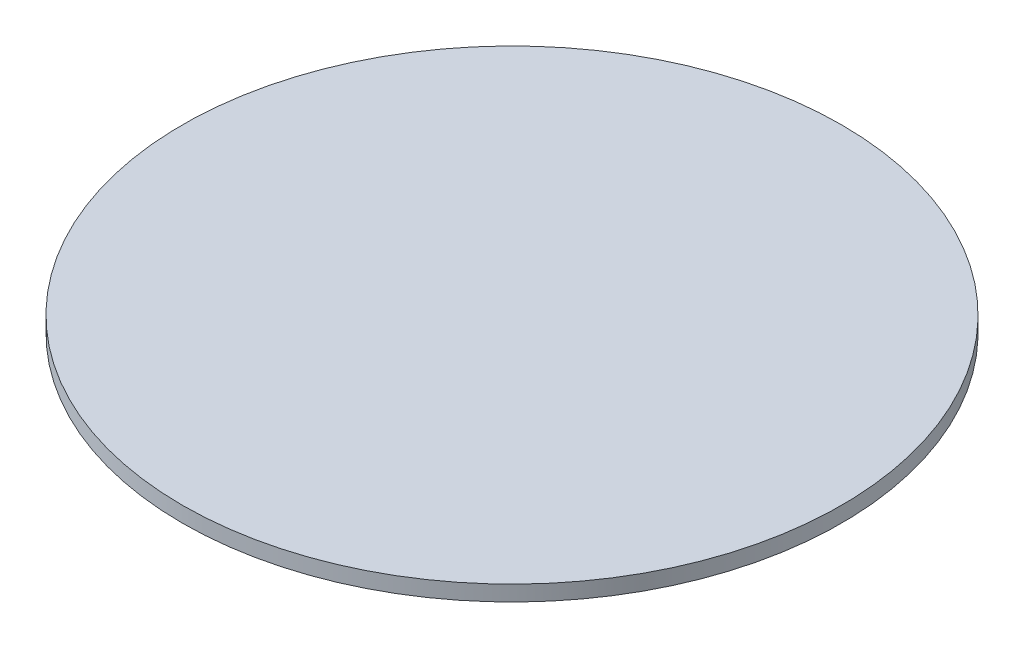
ISO-10303-21;
HEADER;
FILE_DESCRIPTION(('STEP AP214'),'2;1');
FILE_NAME('part.step','',(''),(''),'','','');
FILE_SCHEMA(('AUTOMOTIVE_DESIGN { 1 0 10303 214 1 1 1 1 }'));
ENDSEC;
DATA;
#1=APPLICATION_CONTEXT('core data for automotive mechanical design processes');
#2=APPLICATION_PROTOCOL_DEFINITION('international standard','automotive_design',2000,#1);
#3=PRODUCT_CONTEXT('',#1,'mechanical');
#4=PRODUCT('Part','Part','',(#3));
#5=PRODUCT_RELATED_PRODUCT_CATEGORY('part','',(#4));
#6=PRODUCT_DEFINITION_FORMATION('','',#4);
#7=PRODUCT_DEFINITION_CONTEXT('part definition',#1,'design');
#8=PRODUCT_DEFINITION('design','',#6,#7);
#9=PRODUCT_DEFINITION_SHAPE('','',#8);
#10=(LENGTH_UNIT() NAMED_UNIT(*) SI_UNIT(.MILLI.,.METRE.));
#11=(NAMED_UNIT(*) PLANE_ANGLE_UNIT() SI_UNIT($,.RADIAN.));
#12=(NAMED_UNIT(*) SI_UNIT($,.STERADIAN.) SOLID_ANGLE_UNIT());
#13=UNCERTAINTY_MEASURE_WITH_UNIT(LENGTH_MEASURE(1.E-05),#10,'distance_accuracy_value','');
#14=(GEOMETRIC_REPRESENTATION_CONTEXT(3) GLOBAL_UNCERTAINTY_ASSIGNED_CONTEXT((#13)) GLOBAL_UNIT_ASSIGNED_CONTEXT((#10,
#11,#12)) REPRESENTATION_CONTEXT('',''));
#15=CARTESIAN_POINT('',(0.,0.,0.));
#16=DIRECTION('',(0.,0.,1.));
#17=DIRECTION('',(1.,0.,0.));
#18=AXIS2_PLACEMENT_3D('',#15,#16,#17);
#19=CARTESIAN_POINT('',(0.,1.,0.));
#20=DIRECTION('',(0.,-1.,0.));
#21=DIRECTION('',(0.,0.,-1.));
#22=AXIS2_PLACEMENT_3D('',#19,#20,#21);
#23=CYLINDRICAL_SURFACE('',#22,84.9999999999999);
#24=CARTESIAN_POINT('',(0.,1.,0.));
#25=DIRECTION('',(0.,1.,0.));
#26=DIRECTION('',(0.,0.,1.));
#27=AXIS2_PLACEMENT_3D('',#24,#25,#26);
#28=CIRCLE('',#27,84.9999999999999);
#29=CARTESIAN_POINT('',(0.,1.,84.9999999999999));
#30=VERTEX_POINT('',#29);
#31=EDGE_CURVE('E10',#30,#30,#28,.T.);
#32=ORIENTED_EDGE('',*,*,#31,.F.);
#33=EDGE_LOOP('',(#32));
#34=FACE_BOUND('',#33,.T.);
#35=CARTESIAN_POINT('',(0.,-3.,0.));
#36=DIRECTION('',(0.,1.,0.));
#37=DIRECTION('',(0.,0.,1.));
#38=AXIS2_PLACEMENT_3D('',#35,#36,#37);
#39=CIRCLE('',#38,84.9999999999999);
#40=CARTESIAN_POINT('',(0.,-3.,84.9999999999999));
#41=VERTEX_POINT('',#40);
#42=EDGE_CURVE('E36',#41,#41,#39,.T.);
#43=ORIENTED_EDGE('',*,*,#42,.T.);
#44=EDGE_LOOP('',(#43));
#45=FACE_BOUND('',#44,.T.);
#46=ADVANCED_FACE('F33',(#34,#45),#23,.T.);
#47=CARTESIAN_POINT('',(0.,1.,0.));
#48=DIRECTION('',(0.,1.,0.));
#49=DIRECTION('',(0.,0.,1.));
#50=AXIS2_PLACEMENT_3D('',#47,#48,#49);
#51=PLANE('',#50);
#52=ORIENTED_EDGE('',*,*,#31,.T.);
#53=EDGE_LOOP('',(#52));
#54=FACE_BOUND('',#53,.T.);
#55=ADVANCED_FACE('F48',(#54),#51,.T.);
#56=CARTESIAN_POINT('',(0.,-3.,0.));
#57=DIRECTION('',(0.,1.,0.));
#58=DIRECTION('',(0.,0.,1.));
#59=AXIS2_PLACEMENT_3D('',#56,#57,#58);
#60=PLANE('',#59);
#61=ORIENTED_EDGE('',*,*,#42,.F.);
#62=EDGE_LOOP('',(#61));
#63=FACE_BOUND('',#62,.T.);
#64=ADVANCED_FACE('F46',(#63),#60,.F.);
#65=CLOSED_SHELL('',(#46,#55,#64));
#66=MANIFOLD_SOLID_BREP('B2',#65);
#67=ADVANCED_BREP_SHAPE_REPRESENTATION('',(#18,#66),#14);
#68=SHAPE_DEFINITION_REPRESENTATION(#9,#67);
ENDSEC;
END-ISO-10303-21;
